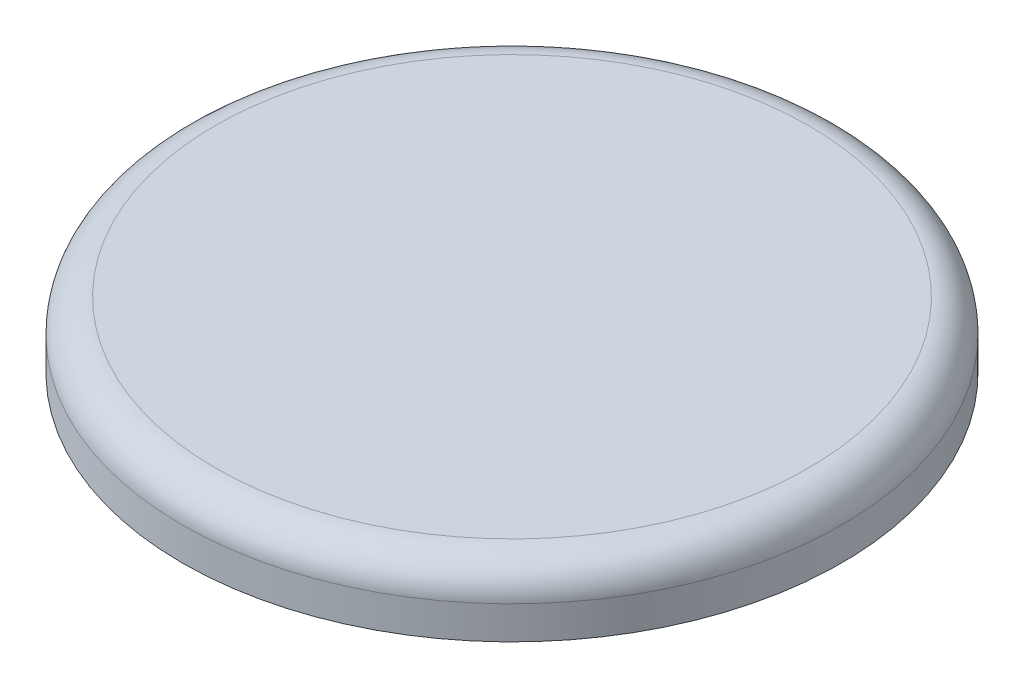
ISO-10303-21;
HEADER;
FILE_DESCRIPTION(('STEP AP214'),'2;1');
FILE_NAME('part.step','',(''),(''),'','','');
FILE_SCHEMA(('AUTOMOTIVE_DESIGN { 1 0 10303 214 1 1 1 1 }'));
ENDSEC;
DATA;
#1=APPLICATION_CONTEXT('core data for automotive mechanical design processes');
#2=APPLICATION_PROTOCOL_DEFINITION('international standard','automotive_design',2000,#1);
#3=PRODUCT_CONTEXT('',#1,'mechanical');
#4=PRODUCT('Part','Part','',(#3));
#5=PRODUCT_RELATED_PRODUCT_CATEGORY('part','',(#4));
#6=PRODUCT_DEFINITION_FORMATION('','',#4);
#7=PRODUCT_DEFINITION_CONTEXT('part definition',#1,'design');
#8=PRODUCT_DEFINITION('design','',#6,#7);
#9=PRODUCT_DEFINITION_SHAPE('','',#8);
#10=(LENGTH_UNIT() NAMED_UNIT(*) SI_UNIT(.MILLI.,.METRE.));
#11=(NAMED_UNIT(*) PLANE_ANGLE_UNIT() SI_UNIT($,.RADIAN.));
#12=(NAMED_UNIT(*) SI_UNIT($,.STERADIAN.) SOLID_ANGLE_UNIT());
#13=UNCERTAINTY_MEASURE_WITH_UNIT(LENGTH_MEASURE(1.E-05),#10,'distance_accuracy_value','');
#14=(GEOMETRIC_REPRESENTATION_CONTEXT(3) GLOBAL_UNCERTAINTY_ASSIGNED_CONTEXT((#13)) GLOBAL_UNIT_ASSIGNED_CONTEXT((#10,
#11,#12)) REPRESENTATION_CONTEXT('',''));
#15=CARTESIAN_POINT('',(0.,0.,0.));
#16=DIRECTION('',(0.,0.,1.));
#17=DIRECTION('',(1.,0.,0.));
#18=AXIS2_PLACEMENT_3D('',#15,#16,#17);
#19=CARTESIAN_POINT('',(0.,2.,0.));
#20=DIRECTION('',(0.,-1.,0.));
#21=DIRECTION('',(0.,0.,-1.));
#22=AXIS2_PLACEMENT_3D('',#19,#20,#21);
#23=CYLINDRICAL_SURFACE('',#22,10.);
#24=CARTESIAN_POINT('',(0.,1.,0.));
#25=DIRECTION('',(0.,1.,0.));
#26=DIRECTION('',(0.,0.,1.));
#27=AXIS2_PLACEMENT_3D('',#24,#25,#26);
#28=CIRCLE('',#27,10.);
#29=CARTESIAN_POINT('',(0.,1.,10.));
#30=VERTEX_POINT('',#29);
#31=EDGE_CURVE('E10',#30,#30,#28,.F.);
#32=ORIENTED_EDGE('',*,*,#31,.T.);
#33=EDGE_LOOP('',(#32));
#34=FACE_BOUND('',#33,.T.);
#35=CARTESIAN_POINT('',(0.,0.,0.));
#36=DIRECTION('',(0.,1.,0.));
#37=DIRECTION('',(0.,0.,1.));
#38=AXIS2_PLACEMENT_3D('',#35,#36,#37);
#39=CIRCLE('',#38,10.);
#40=CARTESIAN_POINT('',(0.,0.,10.));
#41=VERTEX_POINT('',#40);
#42=EDGE_CURVE('E42',#41,#41,#39,.T.);
#43=ORIENTED_EDGE('',*,*,#42,.T.);
#44=EDGE_LOOP('',(#43));
#45=FACE_BOUND('',#44,.T.);
#46=ADVANCED_FACE('F31',(#34,#45),#23,.T.);
#47=CARTESIAN_POINT('',(0.,2.,0.));
#48=DIRECTION('',(0.,1.,0.));
#49=DIRECTION('',(0.,0.,1.));
#50=AXIS2_PLACEMENT_3D('',#47,#48,#49);
#51=PLANE('',#50);
#52=CARTESIAN_POINT('',(0.,2.,0.));
#53=DIRECTION('',(0.,1.,0.));
#54=DIRECTION('',(0.,0.,1.));
#55=AXIS2_PLACEMENT_3D('',#52,#53,#54);
#56=CIRCLE('',#55,9.);
#57=CARTESIAN_POINT('',(0.,2.,9.));
#58=VERTEX_POINT('',#57);
#59=EDGE_CURVE('E38',#58,#58,#56,.T.);
#60=ORIENTED_EDGE('',*,*,#59,.T.);
#61=EDGE_LOOP('',(#60));
#62=FACE_BOUND('',#61,.T.);
#63=ADVANCED_FACE('F52',(#62),#51,.T.);
#64=CARTESIAN_POINT('',(0.,0.,0.));
#65=DIRECTION('',(0.,1.,0.));
#66=DIRECTION('',(0.,0.,1.));
#67=AXIS2_PLACEMENT_3D('',#64,#65,#66);
#68=PLANE('',#67);
#69=ORIENTED_EDGE('',*,*,#42,.F.);
#70=EDGE_LOOP('',(#69));
#71=FACE_BOUND('',#70,.T.);
#72=ADVANCED_FACE('F50',(#71),#68,.F.);
#73=CARTESIAN_POINT('',(0.,1.,0.));
#74=DIRECTION('',(0.,1.,0.));
#75=DIRECTION('',(0.,0.,1.));
#76=AXIS2_PLACEMENT_3D('',#73,#74,#75);
#77=TOROIDAL_SURFACE('',#76,9.,1.);
#78=ORIENTED_EDGE('',*,*,#31,.F.);
#79=EDGE_LOOP('',(#78));
#80=FACE_BOUND('',#79,.T.);
#81=ORIENTED_EDGE('',*,*,#59,.F.);
#82=EDGE_LOOP('',(#81));
#83=FACE_BOUND('',#82,.T.);
#84=ADVANCED_FACE('F33',(#80,#83),#77,.T.);
#85=CLOSED_SHELL('',(#46,#63,#72,#84));
#86=MANIFOLD_SOLID_BREP('B2',#85);
#87=ADVANCED_BREP_SHAPE_REPRESENTATION('',(#18,#86),#14);
#88=SHAPE_DEFINITION_REPRESENTATION(#9,#87);
ENDSEC;
END-ISO-10303-21;
